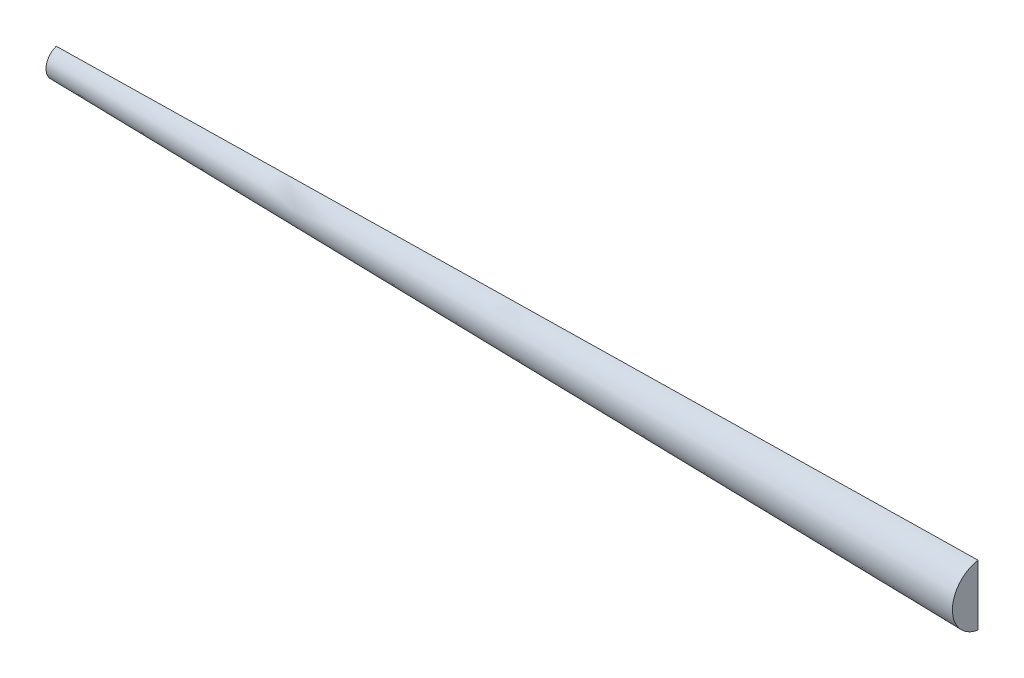
ISO-10303-21;
HEADER;
FILE_DESCRIPTION(('STEP AP214'),'2;1');
FILE_NAME('part.step','',(''),(''),'','','');
FILE_SCHEMA(('AUTOMOTIVE_DESIGN { 1 0 10303 214 1 1 1 1 }'));
ENDSEC;
DATA;
#1=APPLICATION_CONTEXT('core data for automotive mechanical design processes');
#2=APPLICATION_PROTOCOL_DEFINITION('international standard','automotive_design',2000,#1);
#3=PRODUCT_CONTEXT('',#1,'mechanical');
#4=PRODUCT('Part','Part','',(#3));
#5=PRODUCT_RELATED_PRODUCT_CATEGORY('part','',(#4));
#6=PRODUCT_DEFINITION_FORMATION('','',#4);
#7=PRODUCT_DEFINITION_CONTEXT('part definition',#1,'design');
#8=PRODUCT_DEFINITION('design','',#6,#7);
#9=PRODUCT_DEFINITION_SHAPE('','',#8);
#10=(LENGTH_UNIT() NAMED_UNIT(*) SI_UNIT(.MILLI.,.METRE.));
#11=(NAMED_UNIT(*) PLANE_ANGLE_UNIT() SI_UNIT($,.RADIAN.));
#12=(NAMED_UNIT(*) SI_UNIT($,.STERADIAN.) SOLID_ANGLE_UNIT());
#13=UNCERTAINTY_MEASURE_WITH_UNIT(LENGTH_MEASURE(1.E-05),#10,'distance_accuracy_value','');
#14=(GEOMETRIC_REPRESENTATION_CONTEXT(3) GLOBAL_UNCERTAINTY_ASSIGNED_CONTEXT((#13)) GLOBAL_UNIT_ASSIGNED_CONTEXT((#10,
#11,#12)) REPRESENTATION_CONTEXT('',''));
#15=CARTESIAN_POINT('',(0.,0.,0.));
#16=DIRECTION('',(0.,0.,1.));
#17=DIRECTION('',(1.,0.,0.));
#18=AXIS2_PLACEMENT_3D('',#15,#16,#17);
#19=CARTESIAN_POINT('',(-10.5482343550447,2.95803989154981,0.499999999999999));
#20=DIRECTION('',(0.,0.,1.));
#21=DIRECTION('',(1.,0.,0.));
#22=AXIS2_PLACEMENT_3D('',#19,#20,#21);
#23=PLANE('',#22);
#24=CARTESIAN_POINT('',(169.656200493974,-4.47539671188116,0.499999999999999));
#25=CARTESIAN_POINT('',(166.703664294802,-4.42588148318487,0.499999999999999));
#26=CARTESIAN_POINT('',(163.7511282617,-4.37635634763244,0.499999999999999));
#27=CARTESIAN_POINT('',(154.893500783821,-4.22774699927117,0.499999999999999));
#28=CARTESIAN_POINT('',(148.988409902847,-4.12862917903997,0.499999999999999));
#29=CARTESIAN_POINT('',(140.130794713221,-3.97987001919217,0.499999999999999));
#30=CARTESIAN_POINT('',(137.178269709589,-3.93027006028798,0.499999999999999));
#31=CARTESIAN_POINT('',(131.273220624869,-3.83103897027866,0.499999999999999));
#32=CARTESIAN_POINT('',(128.320696543779,-3.78140783917772,0.499999999999999));
#33=CARTESIAN_POINT('',(113.558381591971,-3.53317134744906,0.499999999999999));
#34=CARTESIAN_POINT('',(101.748595056309,-3.33430815609334,0.499999999999999));
#35=CARTESIAN_POINT('',(78.1290247302833,-2.93568248590202,0.499999999999999));
#36=CARTESIAN_POINT('',(66.3192409399359,-2.73592000612207,0.499999999999999));
#37=CARTESIAN_POINT('',(48.6042378005403,-2.4349762757184,0.499999999999999));
#38=CARTESIAN_POINT('',(42.6990074646241,-2.33444203687679,0.499999999999999));
#39=CARTESIAN_POINT('',(30.8885576156639,-2.13273241991245,0.499999999999999));
#40=CARTESIAN_POINT('',(24.9833381026203,-2.0315570417773,0.499999999999999));
#41=CARTESIAN_POINT('',(13.1729426179409,-1.82821800924407,0.499999999999999));
#42=CARTESIAN_POINT('',(7.2677666462288,-1.72605435928811,0.499999999999999));
#43=CARTESIAN_POINT('',(-4.5425567954561,-1.52010252339596,0.499999999999999));
#44=CARTESIAN_POINT('',(-10.4477042654303,-1.41631433754119,0.499999999999999));
#45=CARTESIAN_POINT('',(-19.8607121926005,-1.24840302755795,0.499999999999999));
#46=CARTESIAN_POINT('',(-23.3685904619584,-1.18528205395844,0.499999999999999));
#47=CARTESIAN_POINT('',(-28.6304048779247,-1.08925819863948,0.499999999999999));
#48=CARTESIAN_POINT('',(-30.3843532560919,-1.05702631294972,0.499999999999999));
#49=CARTESIAN_POINT('',(-33.8922387762596,-0.99197115610505,0.499999999999999));
#50=CARTESIAN_POINT('',(-35.6461759182619,-0.959147885045938,0.499999999999999));
#51=CARTESIAN_POINT('',(-39.1537391622849,-0.892710640547071,0.499999999999999));
#52=CARTESIAN_POINT('',(-40.9073652668423,-0.859096801488139,0.499999999999999));
#53=CARTESIAN_POINT('',(-44.4145966644939,-0.790743750861813,0.499999999999999));
#54=CARTESIAN_POINT('',(-46.1682019575745,-0.756004538598457,0.499999999999999));
#55=CARTESIAN_POINT('',(-49.6753155931781,-0.684864605735014,0.499999999999999));
#56=CARTESIAN_POINT('',(-51.4288239369103,-0.648463945464205,0.499999999999999));
#57=CARTESIAN_POINT('',(-54.0590409304299,-0.591800346433796,0.499999999999999));
#58=CARTESIAN_POINT('',(-54.9357717583456,-0.57256872545883,0.499999999999999));
#59=CARTESIAN_POINT('',(-56.6892123367694,-0.533169854457441,0.499999999999999));
#60=CARTESIAN_POINT('',(-57.5659220872829,-0.513002604671454,0.499999999999999));
#61=CARTESIAN_POINT('',(-58.8808841717626,-0.48175911368687,0.499999999999999));
#62=CARTESIAN_POINT('',(-59.3191483164453,-0.471180177921832,0.499999999999999));
#63=CARTESIAN_POINT('',(-60.1956673174125,-0.449614053466663,0.499999999999999));
#64=CARTESIAN_POINT('',(-60.6339221736804,-0.438626864098667,0.499999999999999));
#65=CARTESIAN_POINT('',(-61.5104571454709,-0.416143205002313,0.499999999999999));
#66=CARTESIAN_POINT('',(-61.9487372598603,-0.404646690913838,0.499999999999999));
#67=CARTESIAN_POINT('',(-62.8252777193755,-0.380999618634764,0.499999999999999));
#68=CARTESIAN_POINT('',(-63.2635380645889,-0.368849063699184,0.499999999999999));
#69=CARTESIAN_POINT('',(-64.1402692280098,-0.34367014523336,0.499999999999999));
#70=CARTESIAN_POINT('',(-64.5787400329393,-0.330641314085131,0.499999999999999));
#71=CARTESIAN_POINT('',(-65.4556510709307,-0.303344488101746,0.499999999999999));
#72=CARTESIAN_POINT('',(-65.8940913032957,-0.28907647084461,0.499999999999999));
#73=CARTESIAN_POINT('',(-66.7708240751146,-0.258681747216347,0.499999999999999));
#74=CARTESIAN_POINT('',(-67.2091166266868,-0.242555404626924,0.499999999999999));
#75=CARTESIAN_POINT('',(-67.8664455638075,-0.215815756695967,0.499999999999999));
#76=CARTESIAN_POINT('',(-68.08553347561,-0.20647768403609,0.499999999999999));
#77=CARTESIAN_POINT('',(-68.5236507261605,-0.186527394984251,0.499999999999999));
#78=CARTESIAN_POINT('',(-68.7426800654896,-0.175915191738364,0.499999999999999));
#79=CARTESIAN_POINT('',(-69.0711791295375,-0.158363865471686,0.499999999999999));
#80=CARTESIAN_POINT('',(-69.180691716543,-0.152239960556257,0.499999999999999));
#81=CARTESIAN_POINT('',(-69.3996971098207,-0.139193279631373,0.499999999999999));
#82=CARTESIAN_POINT('',(-69.5091899037649,-0.132270298601012,0.499999999999999));
#83=CARTESIAN_POINT('',(-69.7280470867871,-0.117223951085633,0.499999999999999));
#84=CARTESIAN_POINT('',(-69.8374115121909,-0.109101158231665,0.499999999999999));
#85=CARTESIAN_POINT('',(-70.0012830618838,-0.0951250513520696,0.499999999999999));
#86=CARTESIAN_POINT('',(-70.0558678904127,-0.0901687526846381,0.499999999999999));
#87=CARTESIAN_POINT('',(-70.1649434207622,-0.079316607024152,0.499999999999999));
#88=CARTESIAN_POINT('',(-70.2194341409384,-0.073420970874462,0.499999999999999));
#89=CARTESIAN_POINT('',(-70.3010086009303,-0.0630860165540259,0.499999999999999));
#90=CARTESIAN_POINT('',(-70.3281917433004,-0.0593893994979205,0.499999999999999));
#91=CARTESIAN_POINT('',(-70.3824393092316,-0.0512078894224281,0.499999999999999));
#92=CARTESIAN_POINT('',(-70.4095038302419,-0.0467238646062361,0.499999999999999));
#93=CARTESIAN_POINT('',(-70.449767033295,-0.038503253067905,0.499999999999999));
#94=CARTESIAN_POINT('',(-70.4631372633285,-0.035512605869866,0.499999999999999));
#95=CARTESIAN_POINT('',(-70.4898346304535,-0.0286811286145876,0.499999999999999));
#96=CARTESIAN_POINT('',(-70.5031611626842,-0.0248358726180482,0.499999999999999));
#97=CARTESIAN_POINT('',(-70.5189920479394,-0.0179522509488973,0.499999999999999));
#98=CARTESIAN_POINT('',(-70.5221493660641,-0.0164540413731687,0.499999999999999));
#99=CARTESIAN_POINT('',(-70.5282164673285,-0.0130463525437786,0.499999999999999));
#100=CARTESIAN_POINT('',(-70.5311295814214,-0.0111444150868513,0.499999999999999));
#101=CARTESIAN_POINT('',(-70.5341128071544,-0.00830005859888428,0.499999999999999));
#102=CARTESIAN_POINT('',(-70.5345927065408,-0.00780751829097454,0.499999999999999));
#103=CARTESIAN_POINT('',(-70.535498882544,-0.00677267531353107,0.499999999999999));
#104=CARTESIAN_POINT('',(-70.53592503823,-0.00623026500600483,0.499999999999999));
#105=CARTESIAN_POINT('',(-70.5367044150296,-0.00508253231314861,0.499999999999999));
#106=CARTESIAN_POINT('',(-70.5370565068782,-0.00447642167263718,0.499999999999999));
#107=CARTESIAN_POINT('',(-70.5376402847741,-0.00320894492509517,0.499999999999999));
#108=CARTESIAN_POINT('',(-70.5378724708291,-0.00254782184698699,0.499999999999999));
#109=CARTESIAN_POINT('',(-70.5381300509285,-0.00139971656205069,0.499999999999999));
#110=CARTESIAN_POINT('',(-70.5381971940578,-0.000922122662864802,0.499999999999999));
#111=CARTESIAN_POINT('',(-70.5382480406264,3.75242880010458E-05,0.499999999999999));
#112=CARTESIAN_POINT('',(-70.5382317784682,0.000519575419305245,0.499999999999999));
#113=CARTESIAN_POINT('',(-70.5381178965544,0.00147236793561197,0.499999999999999));
#114=CARTESIAN_POINT('',(-70.5380204925059,0.00194313590572422,0.499999999999999));
#115=CARTESIAN_POINT('',(-70.5377549229276,0.00286414571435465,0.499999999999999));
#116=CARTESIAN_POINT('',(-70.5375866878067,0.00331436688223722,0.499999999999999));
#117=CARTESIAN_POINT('',(-70.5370805250554,0.00443896649202779,0.499999999999999));
#118=CARTESIAN_POINT('',(-70.5367005766964,0.0050942635211352,0.499999999999999));
#119=CARTESIAN_POINT('',(-70.5358461312167,0.00633979415100653,0.499999999999999));
#120=CARTESIAN_POINT('',(-70.5353713431506,0.00692981863613768,0.499999999999999));
#121=CARTESIAN_POINT('',(-70.5336297211297,0.00887017026390579,0.499999999999999));
#122=CARTESIAN_POINT('',(-70.532212537602,0.0100826129072764,0.499999999999999));
#123=CARTESIAN_POINT('',(-70.5292255565047,0.0123022808541486,0.499999999999999));
#124=CARTESIAN_POINT('',(-70.5276547999341,0.013308076602215,0.499999999999999));
#125=CARTESIAN_POINT('',(-70.5200747480674,0.0177656168714404,0.499999999999999));
#126=CARTESIAN_POINT('',(-70.5136187603184,0.020425344044354,0.499999999999999));
#127=CARTESIAN_POINT('',(-70.5005269121448,0.0251652815261664,0.499999999999999));
#128=CARTESIAN_POINT('',(-70.4938904908612,0.0272433846109182,0.499999999999999));
#129=CARTESIAN_POINT('',(-70.460794897434,0.0368083830395781,0.499999999999999));
#130=CARTESIAN_POINT('',(-70.4337124879001,0.0421309377943827,0.499999999999999));
#131=CARTESIAN_POINT('',(-70.3794803351002,0.0516514435492557,0.499999999999999));
#132=CARTESIAN_POINT('',(-70.3523307138449,0.0558507549257622,0.499999999999999));
#133=CARTESIAN_POINT('',(-70.2709016464881,0.067380605572544,0.499999999999999));
#134=CARTESIAN_POINT('',(-70.2164567768266,0.0736790205094041,0.499999999999999));
#135=CARTESIAN_POINT('',(-70.1074539347625,0.0852001141922138,0.499999999999999));
#136=CARTESIAN_POINT('',(-70.0528959175517,0.090422217945255,0.499999999999999));
#137=CARTESIAN_POINT('',(-69.9436910883742,0.100155814941795,0.499999999999999));
#138=CARTESIAN_POINT('',(-69.8890442517646,0.104667055313296,0.499999999999999));
#139=CARTESIAN_POINT('',(-69.7797284139806,0.11321742914132,0.499999999999999));
#140=CARTESIAN_POINT('',(-69.7250594205877,0.117256668875745,0.499999999999999));
#141=CARTESIAN_POINT('',(-69.4518803255036,0.136628019810029,0.499999999999999));
#142=CARTESIAN_POINT('',(-69.2331998226532,0.1495382553937,0.499999999999999));
#143=CARTESIAN_POINT('',(-68.7957026978419,0.173208459144945,0.499999999999999));
#144=CARTESIAN_POINT('',(-68.5768860603837,0.183968104490159,0.499999999999999));
#145=CARTESIAN_POINT('',(-68.139255179721,0.204136888499722,0.499999999999999));
#146=CARTESIAN_POINT('',(-67.9204409556353,0.213546432841945,0.499999999999999));
#147=CARTESIAN_POINT('',(-67.4827907432254,0.231479802402566,0.499999999999999));
#148=CARTESIAN_POINT('',(-67.2639547570468,0.240003681682267,0.499999999999999));
#149=CARTESIAN_POINT('',(-66.6074698907021,0.264620522548474,0.499999999999999));
#150=CARTESIAN_POINT('',(-66.1697853160462,0.279761233252423,0.499999999999999));
#151=CARTESIAN_POINT('',(-65.2943658523369,0.308521284240956,0.499999999999999));
#152=CARTESIAN_POINT('',(-64.8566309630841,0.322140618272599,0.499999999999999));
#153=CARTESIAN_POINT('',(-63.5433512478542,0.361462773287495,0.499999999999999));
#154=CARTESIAN_POINT('',(-62.667760586461,0.385628735649447,0.499999999999999));
#155=CARTESIAN_POINT('',(-60.9164483208477,0.431726471280169,0.499999999999999));
#156=CARTESIAN_POINT('',(-60.0407267118145,0.45365805563494,0.499999999999999));
#157=CARTESIAN_POINT('',(-58.2892606511402,0.496046602460346,0.499999999999999));
#158=CARTESIAN_POINT('',(-57.4135162000194,0.516503586461887,0.499999999999999));
#159=CARTESIAN_POINT('',(-54.7863755508785,0.576370027655592,0.499999999999999));
#160=CARTESIAN_POINT('',(-53.0349453925038,0.614278150164882,0.499999999999999));
#161=CARTESIAN_POINT('',(-49.5320379655869,0.687869510033285,0.499999999999999));
#162=CARTESIAN_POINT('',(-47.7805606970145,0.723552745929739,0.499999999999999));
#163=CARTESIAN_POINT('',(-44.2775647893877,0.793480099909201,0.499999999999999));
#164=CARTESIAN_POINT('',(-42.5260461501253,0.827724207557074,0.499999999999999));
#165=CARTESIAN_POINT('',(-39.0229904525629,0.895226026284407,0.499999999999999));
#166=CARTESIAN_POINT('',(-37.2714533942683,0.928483737643642,0.499999999999999));
#167=CARTESIAN_POINT('',(-32.0169856762934,1.02720288166651,0.499999999999999));
#168=CARTESIAN_POINT('',(-28.5140353049617,1.09161352041003,0.499999999999999));
#169=CARTESIAN_POINT('',(-21.5081155819438,1.2188341835183,0.499999999999999));
#170=CARTESIAN_POINT('',(-18.0051462303389,1.28164421239245,0.499999999999999));
#171=CARTESIAN_POINT('',(-10.6689277189564,1.41210379953621,0.499999999999999));
#172=CARTESIAN_POINT('',(-6.83567674606185,1.47965132672513,0.499999999999999));
#173=CARTESIAN_POINT('',(0.830839465562835,1.61393259768812,0.499999999999999));
#174=CARTESIAN_POINT('',(4.6641047042931,1.68066634145245,0.499999999999999));
#175=CARTESIAN_POINT('',(16.1639151999268,1.88003261608198,0.499999999999999));
#176=CARTESIAN_POINT('',(23.8304749220555,2.01183018474498,0.499999999999999));
#177=CARTESIAN_POINT('',(39.163623566938,2.27423458833846,0.499999999999999));
#178=CARTESIAN_POINT('',(46.8302124897152,2.40484142188913,0.499999999999999));
#179=CARTESIAN_POINT('',(62.1634026838333,2.66531792587882,0.499999999999999));
#180=CARTESIAN_POINT('',(69.8300039551738,2.7951875963344,0.499999999999999));
#181=CARTESIAN_POINT('',(85.1633052105721,3.0544488291263,0.499999999999999));
#182=CARTESIAN_POINT('',(92.8300051947257,3.18384038579388,0.499999999999999));
#183=CARTESIAN_POINT('',(108.163410821167,3.44229038151669,0.499999999999999));
#184=CARTESIAN_POINT('',(115.830116463454,3.57134882056997,0.499999999999999));
#185=CARTESIAN_POINT('',(138.830235386062,3.95817021023349,0.499999999999999));
#186=CARTESIAN_POINT('',(154.163654617222,4.21557930010855,0.499999999999999));
#187=CARTESIAN_POINT('',(169.550118969222,4.47361768319345,0.499999999999999));
#188=CARTESIAN_POINT('',(169.603159731572,4.47450719908985,0.499999999999999));
#189=CARTESIAN_POINT('',(169.656200493974,4.4753967118812,0.499999999999999));
#190=B_SPLINE_CURVE_WITH_KNOTS('',3,(#24,#25,#26,#27,#28,#29,#30,#31,#32,#33,#34,#35,#36,#37,
#38,#39,#40,#41,#42,#43,#44,#45,#46,#47,#48,#49,#50,#51,#52,#53,#54,#55,#56,#57,#58,#59,#60,#61,
#62,#63,#64,#65,#66,#67,#68,#69,#70,#71,#72,#73,#74,#75,#76,#77,#78,#79,#80,#81,#82,#83,#84,#85,
#86,#87,#88,#89,#90,#91,#92,#93,#94,#95,#96,#97,#98,#99,#100,#101,#102,#103,#104,#105,#106,#107,
#108,#109,#110,#111,#112,#113,#114,#115,#116,#117,#118,#119,#120,#121,#122,#123,#124,#125,#126,
#127,#128,#129,#130,#131,#132,#133,#134,#135,#136,#137,#138,#139,#140,#141,#142,#143,#144,#145,
#146,#147,#148,#149,#150,#151,#152,#153,#154,#155,#156,#157,#158,#159,#160,#161,#162,#163,#164,
#165,#166,#167,#168,#169,#170,#171,#172,#173,#174,#175,#176,#177,#178,#179,#180,#181,#182,#183,
#184,#185,#186,#187,#188,#189),.UNSPECIFIED.,.F.,.F.,(4,2,2,2,2,2,2,2,2,2,2,2,2,2,2,2,2,2,2,2,2,
2,2,2,2,2,2,2,2,2,2,2,2,2,2,2,2,2,2,2,2,2,2,2,2,2,2,2,2,2,2,2,2,2,2,2,2,2,2,2,2,2,2,2,2,2,2,2,2,
2,2,2,2,2,2,2,2,2,2,2,2,2,4),(0.,8.85885409576343,26.5766221228227,35.4354469023524,
44.2942704859123,79.7286526655942,115.163072063759,132.881330199528,150.599588678475,
168.317767553834,186.035945541324,196.561283590795,201.824017051998,207.086749660777,
212.348594084307,217.610441761974,222.872098527062,225.502923411211,228.1337476193,
229.448922888453,230.76410034142,232.07939256707,233.394678247402,234.710669838581,
236.026685246431,237.342443470223,238.000302045535,238.658153833855,238.987202305085,
239.316335389539,239.645311621489,239.809740370115,239.974132262983,240.056441217293,
240.138659980389,240.179799027703,240.221156311888,240.23164303465,240.24194882557,
240.244008730076,240.246073189949,240.248167151128,240.250252308504,240.251692502244,
240.253132101989,240.25456788688,240.256005085727,240.258264333713,240.260530622019,
240.266082544123,240.271671668435,240.292470077676,240.313342891908,240.395898740003,
240.478354146086,240.64269895903,240.807131342892,240.971622088084,241.1360757241,
241.793220199709,242.450463244479,243.107508385645,243.764513396956,245.07834689721,
246.392185797193,249.019951284832,251.647938762852,254.275887861375,259.531405946427,
264.786927486465,270.042487127772,275.298045278412,285.808671980283,296.319269067341,
307.820807127705,319.322345325461,342.325422663772,365.328526654422,388.33163012812,
411.335005467533,434.338380940451,480.345120019314,480.504264681124),.UNSPECIFIED.);
#191=CARTESIAN_POINT('',(79.4617656449553,-2.9580398915498,0.499999999999999));
#192=VERTEX_POINT('',#191);
#193=CARTESIAN_POINT('',(-10.5382343550447,-1.4142135623731,0.499999999999999));
#194=VERTEX_POINT('',#193);
#195=EDGE_CURVE('E64',#192,#194,#190,.T.);
#196=ORIENTED_EDGE('',*,*,#195,.T.);
#197=DIRECTION('',(0.,1.,0.));
#198=VECTOR('',#197,1.);
#199=CARTESIAN_POINT('',(-10.5382343550447,0.,0.499999999999999));
#200=LINE('',#199,#198);
#201=CARTESIAN_POINT('',(-10.5382343550447,1.4142135623731,0.499999999999999));
#202=VERTEX_POINT('',#201);
#203=EDGE_CURVE('E37',#194,#202,#200,.T.);
#204=ORIENTED_EDGE('',*,*,#203,.T.);
#205=CARTESIAN_POINT('',(79.4617656449553,2.95803989154982,0.499999999999999));
#206=VERTEX_POINT('',#205);
#207=EDGE_CURVE('E42',#202,#206,#190,.T.);
#208=ORIENTED_EDGE('',*,*,#207,.T.);
#209=DIRECTION('',(0.,-1.,0.));
#210=VECTOR('',#209,1.);
#211=CARTESIAN_POINT('',(79.4617656449553,3.00000000000001,0.499999999999999));
#212=LINE('',#211,#210);
#213=EDGE_CURVE('E11',#206,#192,#212,.T.);
#214=ORIENTED_EDGE('',*,*,#213,.T.);
#215=EDGE_LOOP('',(#196,#204,#208,#214));
#216=FACE_BOUND('',#215,.T.);
#217=ADVANCED_FACE('F33',(#216),#23,.F.);
#218=CARTESIAN_POINT('',(79.4617656449553,3.00000000000001,0.));
#219=DIRECTION('',(1.,0.,0.));
#220=DIRECTION('',(0.,1.,0.));
#221=AXIS2_PLACEMENT_3D('',#218,#219,#220);
#222=PLANE('',#221);
#223=ORIENTED_EDGE('',*,*,#213,.F.);
#224=CARTESIAN_POINT('',(79.4617656449553,0.,0.));
#225=DIRECTION('',(1.,0.,0.));
#226=DIRECTION('',(0.,1.,0.));
#227=AXIS2_PLACEMENT_3D('',#224,#225,#226);
#228=CIRCLE('',#227,3.);
#229=EDGE_CURVE('E68',#206,#192,#228,.T.);
#230=ORIENTED_EDGE('',*,*,#229,.T.);
#231=EDGE_LOOP('',(#223,#230));
#232=FACE_BOUND('',#231,.T.);
#233=ADVANCED_FACE('F79',(#232),#222,.T.);
#234=CARTESIAN_POINT('',(-10.5382343550447,0.,0.));
#235=DIRECTION('',(-1.,0.,0.));
#236=DIRECTION('',(0.,-1.,0.));
#237=AXIS2_PLACEMENT_3D('',#234,#235,#236);
#238=PLANE('',#237);
#239=ORIENTED_EDGE('',*,*,#203,.F.);
#240=CARTESIAN_POINT('',(-10.5382343550447,0.,0.));
#241=DIRECTION('',(1.,0.,0.));
#242=DIRECTION('',(0.,1.,0.));
#243=AXIS2_PLACEMENT_3D('',#240,#241,#242);
#244=CIRCLE('',#243,1.5);
#245=EDGE_CURVE('E63',#202,#194,#244,.T.);
#246=ORIENTED_EDGE('',*,*,#245,.F.);
#247=EDGE_LOOP('',(#239,#246));
#248=FACE_BOUND('',#247,.T.);
#249=ADVANCED_FACE('F61',(#248),#238,.T.);
#250=CARTESIAN_POINT('',(79.4617656449553,0.,0.));
#251=DIRECTION('',(1.,0.,0.));
#252=DIRECTION('',(0.,1.,0.));
#253=AXIS2_PLACEMENT_3D('',#250,#251,#252);
#254=CONICAL_SURFACE('',#253,3.,0.0166651237139408);
#255=ORIENTED_EDGE('',*,*,#195,.F.);
#256=ORIENTED_EDGE('',*,*,#229,.F.);
#257=ORIENTED_EDGE('',*,*,#207,.F.);
#258=ORIENTED_EDGE('',*,*,#245,.T.);
#259=EDGE_LOOP('',(#255,#256,#257,#258));
#260=FACE_BOUND('',#259,.T.);
#261=ADVANCED_FACE('F67',(#260),#254,.T.);
#262=CLOSED_SHELL('',(#217,#233,#249,#261));
#263=MANIFOLD_SOLID_BREP('B2',#262);
#264=ADVANCED_BREP_SHAPE_REPRESENTATION('',(#18,#263),#14);
#265=SHAPE_DEFINITION_REPRESENTATION(#9,#264);
ENDSEC;
END-ISO-10303-21;
